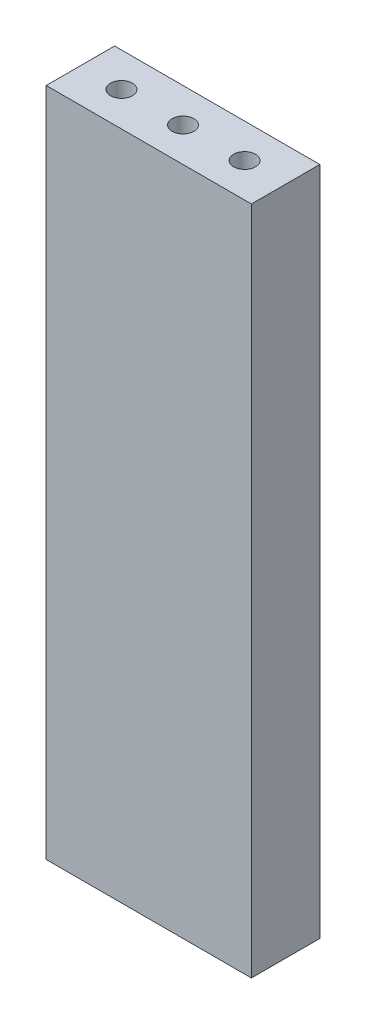
ISO-10303-21;
HEADER;
FILE_DESCRIPTION(('STEP AP214'),'2;1');
FILE_NAME('part.step','',(''),(''),'','','');
FILE_SCHEMA(('AUTOMOTIVE_DESIGN { 1 0 10303 214 1 1 1 1 }'));
ENDSEC;
DATA;
#1=APPLICATION_CONTEXT('core data for automotive mechanical design processes');
#2=APPLICATION_PROTOCOL_DEFINITION('international standard','automotive_design',2000,#1);
#3=PRODUCT_CONTEXT('',#1,'mechanical');
#4=PRODUCT('Part','Part','',(#3));
#5=PRODUCT_RELATED_PRODUCT_CATEGORY('part','',(#4));
#6=PRODUCT_DEFINITION_FORMATION('','',#4);
#7=PRODUCT_DEFINITION_CONTEXT('part definition',#1,'design');
#8=PRODUCT_DEFINITION('design','',#6,#7);
#9=PRODUCT_DEFINITION_SHAPE('','',#8);
#10=(LENGTH_UNIT() NAMED_UNIT(*) SI_UNIT(.MILLI.,.METRE.));
#11=(NAMED_UNIT(*) PLANE_ANGLE_UNIT() SI_UNIT($,.RADIAN.));
#12=(NAMED_UNIT(*) SI_UNIT($,.STERADIAN.) SOLID_ANGLE_UNIT());
#13=UNCERTAINTY_MEASURE_WITH_UNIT(LENGTH_MEASURE(1.E-05),#10,'distance_accuracy_value','');
#14=(GEOMETRIC_REPRESENTATION_CONTEXT(3) GLOBAL_UNCERTAINTY_ASSIGNED_CONTEXT((#13)) GLOBAL_UNIT_ASSIGNED_CONTEXT((#10,
#11,#12)) REPRESENTATION_CONTEXT('',''));
#15=CARTESIAN_POINT('',(0.,0.,0.));
#16=DIRECTION('',(0.,0.,1.));
#17=DIRECTION('',(1.,0.,0.));
#18=AXIS2_PLACEMENT_3D('',#15,#16,#17);
#19=CARTESIAN_POINT('',(7.5,-49.,2.5));
#20=DIRECTION('',(1.,0.,0.));
#21=DIRECTION('',(0.,0.,-1.));
#22=AXIS2_PLACEMENT_3D('',#19,#20,#21);
#23=PLANE('',#22);
#24=DIRECTION('',(0.,0.,-1.));
#25=VECTOR('',#24,1.);
#26=CARTESIAN_POINT('',(7.5,0.,2.5));
#27=LINE('',#26,#25);
#28=CARTESIAN_POINT('',(7.5,0.,2.5));
#29=VERTEX_POINT('',#28);
#30=CARTESIAN_POINT('',(7.5,0.,-2.5));
#31=VERTEX_POINT('',#30);
#32=EDGE_CURVE('E154',#29,#31,#27,.T.);
#33=ORIENTED_EDGE('',*,*,#32,.F.);
#34=DIRECTION('',(0.,1.,0.));
#35=VECTOR('',#34,1.);
#36=CARTESIAN_POINT('',(7.5,-49.,2.5));
#37=LINE('',#36,#35);
#38=CARTESIAN_POINT('',(7.5,-49.,2.5));
#39=VERTEX_POINT('',#38);
#40=EDGE_CURVE('E13',#39,#29,#37,.T.);
#41=ORIENTED_EDGE('',*,*,#40,.F.);
#42=DIRECTION('',(0.,0.,-1.));
#43=VECTOR('',#42,1.);
#44=CARTESIAN_POINT('',(7.5,-49.,2.5));
#45=LINE('',#44,#43);
#46=CARTESIAN_POINT('',(7.5,-49.,-2.5));
#47=VERTEX_POINT('',#46);
#48=EDGE_CURVE('E155',#39,#47,#45,.T.);
#49=ORIENTED_EDGE('',*,*,#48,.T.);
#50=DIRECTION('',(0.,1.,0.));
#51=VECTOR('',#50,1.);
#52=CARTESIAN_POINT('',(7.5,-49.,-2.5));
#53=LINE('',#52,#51);
#54=EDGE_CURVE('E48',#47,#31,#53,.T.);
#55=ORIENTED_EDGE('',*,*,#54,.T.);
#56=EDGE_LOOP('',(#33,#41,#49,#55));
#57=FACE_BOUND('',#56,.T.);
#58=ADVANCED_FACE('F45',(#57),#23,.T.);
#59=CARTESIAN_POINT('',(-7.5,-49.,2.5));
#60=DIRECTION('',(0.,0.,1.));
#61=DIRECTION('',(1.,0.,0.));
#62=AXIS2_PLACEMENT_3D('',#59,#60,#61);
#63=PLANE('',#62);
#64=DIRECTION('',(1.,0.,0.));
#65=VECTOR('',#64,1.);
#66=CARTESIAN_POINT('',(-7.5,0.,2.5));
#67=LINE('',#66,#65);
#68=CARTESIAN_POINT('',(-7.5,0.,2.5));
#69=VERTEX_POINT('',#68);
#70=EDGE_CURVE('E158',#69,#29,#67,.T.);
#71=ORIENTED_EDGE('',*,*,#70,.F.);
#72=DIRECTION('',(0.,1.,0.));
#73=VECTOR('',#72,1.);
#74=CARTESIAN_POINT('',(-7.5,-49.,2.5));
#75=LINE('',#74,#73);
#76=CARTESIAN_POINT('',(-7.5,-49.,2.5));
#77=VERTEX_POINT('',#76);
#78=EDGE_CURVE('E54',#77,#69,#75,.T.);
#79=ORIENTED_EDGE('',*,*,#78,.F.);
#80=DIRECTION('',(1.,0.,0.));
#81=VECTOR('',#80,1.);
#82=CARTESIAN_POINT('',(-7.5,-49.,2.5));
#83=LINE('',#82,#81);
#84=EDGE_CURVE('E162',#77,#39,#83,.T.);
#85=ORIENTED_EDGE('',*,*,#84,.T.);
#86=ORIENTED_EDGE('',*,*,#40,.T.);
#87=EDGE_LOOP('',(#71,#79,#85,#86));
#88=FACE_BOUND('',#87,.T.);
#89=ADVANCED_FACE('F177',(#88),#63,.T.);
#90=CARTESIAN_POINT('',(-7.5,-49.,2.5));
#91=DIRECTION('',(-1.,0.,0.));
#92=DIRECTION('',(0.,0.,1.));
#93=AXIS2_PLACEMENT_3D('',#90,#91,#92);
#94=PLANE('',#93);
#95=DIRECTION('',(0.,0.,1.));
#96=VECTOR('',#95,1.);
#97=CARTESIAN_POINT('',(-7.5,0.,2.5));
#98=LINE('',#97,#96);
#99=CARTESIAN_POINT('',(-7.5,0.,-2.5));
#100=VERTEX_POINT('',#99);
#101=EDGE_CURVE('E169',#100,#69,#98,.T.);
#102=ORIENTED_EDGE('',*,*,#101,.F.);
#103=DIRECTION('',(0.,1.,0.));
#104=VECTOR('',#103,1.);
#105=CARTESIAN_POINT('',(-7.5,-49.,-2.5));
#106=LINE('',#105,#104);
#107=CARTESIAN_POINT('',(-7.5,-49.,-2.5));
#108=VERTEX_POINT('',#107);
#109=EDGE_CURVE('E173',#108,#100,#106,.T.);
#110=ORIENTED_EDGE('',*,*,#109,.F.);
#111=DIRECTION('',(0.,0.,1.));
#112=VECTOR('',#111,1.);
#113=CARTESIAN_POINT('',(-7.5,-49.,2.5));
#114=LINE('',#113,#112);
#115=EDGE_CURVE('E160',#108,#77,#114,.T.);
#116=ORIENTED_EDGE('',*,*,#115,.T.);
#117=ORIENTED_EDGE('',*,*,#78,.T.);
#118=EDGE_LOOP('',(#102,#110,#116,#117));
#119=FACE_BOUND('',#118,.T.);
#120=ADVANCED_FACE('F180',(#119),#94,.T.);
#121=CARTESIAN_POINT('',(-7.5,-49.,-2.5));
#122=DIRECTION('',(0.,0.,-1.));
#123=DIRECTION('',(-1.,0.,0.));
#124=AXIS2_PLACEMENT_3D('',#121,#122,#123);
#125=PLANE('',#124);
#126=DIRECTION('',(-1.,0.,0.));
#127=VECTOR('',#126,1.);
#128=CARTESIAN_POINT('',(-7.5,0.,-2.5));
#129=LINE('',#128,#127);
#130=EDGE_CURVE('E166',#31,#100,#129,.T.);
#131=ORIENTED_EDGE('',*,*,#130,.F.);
#132=ORIENTED_EDGE('',*,*,#54,.F.);
#133=DIRECTION('',(-1.,0.,0.));
#134=VECTOR('',#133,1.);
#135=CARTESIAN_POINT('',(-7.5,-49.,-2.5));
#136=LINE('',#135,#134);
#137=EDGE_CURVE('E157',#47,#108,#136,.T.);
#138=ORIENTED_EDGE('',*,*,#137,.T.);
#139=ORIENTED_EDGE('',*,*,#109,.T.);
#140=EDGE_LOOP('',(#131,#132,#138,#139));
#141=FACE_BOUND('',#140,.T.);
#142=ADVANCED_FACE('F174',(#141),#125,.T.);
#143=CARTESIAN_POINT('',(7.5,-49.,-2.5));
#144=DIRECTION('',(0.,-1.,0.));
#145=DIRECTION('',(0.,0.,-1.));
#146=AXIS2_PLACEMENT_3D('',#143,#144,#145);
#147=PLANE('',#146);
#148=CARTESIAN_POINT('',(-4.5,-49.,0.));
#149=DIRECTION('',(0.,-1.,0.));
#150=DIRECTION('',(0.,0.,-1.));
#151=AXIS2_PLACEMENT_3D('',#148,#149,#150);
#152=CIRCLE('',#151,0.799999999999999);
#153=CARTESIAN_POINT('',(-4.5,-49.,-0.799999999999999));
#154=VERTEX_POINT('',#153);
#155=EDGE_CURVE('E136',#154,#154,#152,.T.);
#156=ORIENTED_EDGE('',*,*,#155,.F.);
#157=EDGE_LOOP('',(#156));
#158=FACE_BOUND('',#157,.T.);
#159=CARTESIAN_POINT('',(4.5,-49.,0.));
#160=DIRECTION('',(0.,-1.,0.));
#161=DIRECTION('',(0.,0.,-1.));
#162=AXIS2_PLACEMENT_3D('',#159,#160,#161);
#163=CIRCLE('',#162,0.799999999999999);
#164=CARTESIAN_POINT('',(4.5,-49.,-0.799999999999999));
#165=VERTEX_POINT('',#164);
#166=EDGE_CURVE('E142',#165,#165,#163,.T.);
#167=ORIENTED_EDGE('',*,*,#166,.F.);
#168=EDGE_LOOP('',(#167));
#169=FACE_BOUND('',#168,.T.);
#170=CARTESIAN_POINT('',(0.,-49.,0.));
#171=DIRECTION('',(0.,-1.,0.));
#172=DIRECTION('',(0.,0.,-1.));
#173=AXIS2_PLACEMENT_3D('',#170,#171,#172);
#174=CIRCLE('',#173,0.799999999999999);
#175=CARTESIAN_POINT('',(0.,-49.,-0.799999999999999));
#176=VERTEX_POINT('',#175);
#177=EDGE_CURVE('E148',#176,#176,#174,.T.);
#178=ORIENTED_EDGE('',*,*,#177,.F.);
#179=EDGE_LOOP('',(#178));
#180=FACE_BOUND('',#179,.T.);
#181=ORIENTED_EDGE('',*,*,#48,.F.);
#182=ORIENTED_EDGE('',*,*,#84,.F.);
#183=ORIENTED_EDGE('',*,*,#115,.F.);
#184=ORIENTED_EDGE('',*,*,#137,.F.);
#185=EDGE_LOOP('',(#181,#182,#183,#184));
#186=FACE_BOUND('',#185,.T.);
#187=ADVANCED_FACE('F182',(#158,#169,#180,#186),#147,.T.);
#188=CARTESIAN_POINT('',(7.5,0.,-2.5));
#189=DIRECTION('',(0.,-1.,0.));
#190=DIRECTION('',(0.,0.,-1.));
#191=AXIS2_PLACEMENT_3D('',#188,#189,#190);
#192=PLANE('',#191);
#193=CARTESIAN_POINT('',(-4.5,0.,0.));
#194=DIRECTION('',(0.,1.,0.));
#195=DIRECTION('',(0.,0.,1.));
#196=AXIS2_PLACEMENT_3D('',#193,#194,#195);
#197=CIRCLE('',#196,0.79999999999999);
#198=CARTESIAN_POINT('',(-4.5,0.,0.79999999999999));
#199=VERTEX_POINT('',#198);
#200=EDGE_CURVE('E120',#199,#199,#197,.T.);
#201=ORIENTED_EDGE('',*,*,#200,.F.);
#202=EDGE_LOOP('',(#201));
#203=FACE_BOUND('',#202,.T.);
#204=CARTESIAN_POINT('',(0.,0.,0.));
#205=DIRECTION('',(0.,1.,0.));
#206=DIRECTION('',(0.,0.,1.));
#207=AXIS2_PLACEMENT_3D('',#204,#205,#206);
#208=CIRCLE('',#207,0.79999999999999);
#209=CARTESIAN_POINT('',(0.,0.,0.79999999999999));
#210=VERTEX_POINT('',#209);
#211=EDGE_CURVE('E119',#210,#210,#208,.T.);
#212=ORIENTED_EDGE('',*,*,#211,.F.);
#213=EDGE_LOOP('',(#212));
#214=FACE_BOUND('',#213,.T.);
#215=CARTESIAN_POINT('',(4.5,0.,0.));
#216=DIRECTION('',(0.,1.,0.));
#217=DIRECTION('',(0.,0.,1.));
#218=AXIS2_PLACEMENT_3D('',#215,#216,#217);
#219=CIRCLE('',#218,0.79999999999999);
#220=CARTESIAN_POINT('',(4.5,0.,0.79999999999999));
#221=VERTEX_POINT('',#220);
#222=EDGE_CURVE('E130',#221,#221,#219,.T.);
#223=ORIENTED_EDGE('',*,*,#222,.F.);
#224=EDGE_LOOP('',(#223));
#225=FACE_BOUND('',#224,.T.);
#226=ORIENTED_EDGE('',*,*,#32,.T.);
#227=ORIENTED_EDGE('',*,*,#130,.T.);
#228=ORIENTED_EDGE('',*,*,#101,.T.);
#229=ORIENTED_EDGE('',*,*,#70,.T.);
#230=EDGE_LOOP('',(#226,#227,#228,#229));
#231=FACE_BOUND('',#230,.T.);
#232=ADVANCED_FACE('F176',(#203,#214,#225,#231),#192,.F.);
#233=CARTESIAN_POINT('',(0.,-37.8,0.));
#234=DIRECTION('',(0.,-1.,0.));
#235=DIRECTION('',(0.,0.,-1.));
#236=AXIS2_PLACEMENT_3D('',#233,#234,#235);
#237=CONICAL_SURFACE('',#236,0.799999999999998,1.02974425867666);
#238=CARTESIAN_POINT('',(0.,-37.319311504778,0.));
#239=VERTEX_POINT('',#238);
#240=VERTEX_LOOP('',#239);
#241=FACE_BOUND('',#240,.T.);
#242=CARTESIAN_POINT('',(0.,-37.8,0.));
#243=DIRECTION('',(0.,-1.,0.));
#244=DIRECTION('',(0.,0.,-1.));
#245=AXIS2_PLACEMENT_3D('',#242,#243,#244);
#246=CIRCLE('',#245,0.799999999999998);
#247=CARTESIAN_POINT('',(0.,-37.8,-0.799999999999998));
#248=VERTEX_POINT('',#247);
#249=EDGE_CURVE('E151',#248,#248,#246,.T.);
#250=ORIENTED_EDGE('',*,*,#249,.T.);
#251=EDGE_LOOP('',(#250));
#252=FACE_BOUND('',#251,.T.);
#253=ADVANCED_FACE('F190',(#241,#252),#237,.F.);
#254=CARTESIAN_POINT('',(0.,-49.,0.));
#255=DIRECTION('',(0.,-1.,0.));
#256=DIRECTION('',(0.,0.,-1.));
#257=AXIS2_PLACEMENT_3D('',#254,#255,#256);
#258=CYLINDRICAL_SURFACE('',#257,0.799999999999998);
#259=ORIENTED_EDGE('',*,*,#249,.F.);
#260=EDGE_LOOP('',(#259));
#261=FACE_BOUND('',#260,.T.);
#262=ORIENTED_EDGE('',*,*,#177,.T.);
#263=EDGE_LOOP('',(#262));
#264=FACE_BOUND('',#263,.T.);
#265=ADVANCED_FACE('F225',(#261,#264),#258,.F.);
#266=CARTESIAN_POINT('',(4.5,-37.8,0.));
#267=DIRECTION('',(0.,-1.,0.));
#268=DIRECTION('',(0.,0.,-1.));
#269=AXIS2_PLACEMENT_3D('',#266,#267,#268);
#270=CONICAL_SURFACE('',#269,0.799999999999998,1.02974425867666);
#271=CARTESIAN_POINT('',(4.5,-37.319311504778,0.));
#272=VERTEX_POINT('',#271);
#273=VERTEX_LOOP('',#272);
#274=FACE_BOUND('',#273,.T.);
#275=CARTESIAN_POINT('',(4.5,-37.8,0.));
#276=DIRECTION('',(0.,-1.,0.));
#277=DIRECTION('',(0.,0.,-1.));
#278=AXIS2_PLACEMENT_3D('',#275,#276,#277);
#279=CIRCLE('',#278,0.799999999999998);
#280=CARTESIAN_POINT('',(4.5,-37.8,-0.799999999999998));
#281=VERTEX_POINT('',#280);
#282=EDGE_CURVE('E145',#281,#281,#279,.T.);
#283=ORIENTED_EDGE('',*,*,#282,.T.);
#284=EDGE_LOOP('',(#283));
#285=FACE_BOUND('',#284,.T.);
#286=ADVANCED_FACE('F235',(#274,#285),#270,.F.);
#287=CARTESIAN_POINT('',(4.5,-49.,0.));
#288=DIRECTION('',(0.,-1.,0.));
#289=DIRECTION('',(0.,0.,-1.));
#290=AXIS2_PLACEMENT_3D('',#287,#288,#289);
#291=CYLINDRICAL_SURFACE('',#290,0.799999999999998);
#292=ORIENTED_EDGE('',*,*,#282,.F.);
#293=EDGE_LOOP('',(#292));
#294=FACE_BOUND('',#293,.T.);
#295=ORIENTED_EDGE('',*,*,#166,.T.);
#296=EDGE_LOOP('',(#295));
#297=FACE_BOUND('',#296,.T.);
#298=ADVANCED_FACE('F246',(#294,#297),#291,.F.);
#299=CARTESIAN_POINT('',(-4.5,-37.8,0.));
#300=DIRECTION('',(0.,-1.,0.));
#301=DIRECTION('',(0.,0.,-1.));
#302=AXIS2_PLACEMENT_3D('',#299,#300,#301);
#303=CONICAL_SURFACE('',#302,0.799999999999998,1.02974425867666);
#304=CARTESIAN_POINT('',(-4.5,-37.319311504778,0.));
#305=VERTEX_POINT('',#304);
#306=VERTEX_LOOP('',#305);
#307=FACE_BOUND('',#306,.T.);
#308=CARTESIAN_POINT('',(-4.5,-37.8,0.));
#309=DIRECTION('',(0.,-1.,0.));
#310=DIRECTION('',(0.,0.,-1.));
#311=AXIS2_PLACEMENT_3D('',#308,#309,#310);
#312=CIRCLE('',#311,0.799999999999998);
#313=CARTESIAN_POINT('',(-4.5,-37.8,-0.799999999999998));
#314=VERTEX_POINT('',#313);
#315=EDGE_CURVE('E139',#314,#314,#312,.T.);
#316=ORIENTED_EDGE('',*,*,#315,.T.);
#317=EDGE_LOOP('',(#316));
#318=FACE_BOUND('',#317,.T.);
#319=ADVANCED_FACE('F256',(#307,#318),#303,.F.);
#320=CARTESIAN_POINT('',(-4.5,-49.,0.));
#321=DIRECTION('',(0.,-1.,0.));
#322=DIRECTION('',(0.,0.,-1.));
#323=AXIS2_PLACEMENT_3D('',#320,#321,#322);
#324=CYLINDRICAL_SURFACE('',#323,0.799999999999998);
#325=ORIENTED_EDGE('',*,*,#315,.F.);
#326=EDGE_LOOP('',(#325));
#327=FACE_BOUND('',#326,.T.);
#328=ORIENTED_EDGE('',*,*,#155,.T.);
#329=EDGE_LOOP('',(#328));
#330=FACE_BOUND('',#329,.T.);
#331=ADVANCED_FACE('F267',(#327,#330),#324,.F.);
#332=CARTESIAN_POINT('',(4.5,-11.2,0.));
#333=DIRECTION('',(0.,1.,0.));
#334=DIRECTION('',(0.,0.,1.));
#335=AXIS2_PLACEMENT_3D('',#332,#333,#334);
#336=CONICAL_SURFACE('',#335,0.799999999999998,1.02974425867665);
#337=CARTESIAN_POINT('',(4.5,-11.680688495222,0.));
#338=VERTEX_POINT('',#337);
#339=VERTEX_LOOP('',#338);
#340=FACE_BOUND('',#339,.T.);
#341=CARTESIAN_POINT('',(4.5,-11.2,0.));
#342=DIRECTION('',(0.,1.,0.));
#343=DIRECTION('',(0.,0.,1.));
#344=AXIS2_PLACEMENT_3D('',#341,#342,#343);
#345=CIRCLE('',#344,0.799999999999998);
#346=CARTESIAN_POINT('',(4.5,-11.2,0.799999999999998));
#347=VERTEX_POINT('',#346);
#348=EDGE_CURVE('E133',#347,#347,#345,.T.);
#349=ORIENTED_EDGE('',*,*,#348,.T.);
#350=EDGE_LOOP('',(#349));
#351=FACE_BOUND('',#350,.T.);
#352=ADVANCED_FACE('F277',(#340,#351),#336,.F.);
#353=CARTESIAN_POINT('',(4.5,0.,0.));
#354=DIRECTION('',(0.,1.,0.));
#355=DIRECTION('',(0.,0.,1.));
#356=AXIS2_PLACEMENT_3D('',#353,#354,#355);
#357=CYLINDRICAL_SURFACE('',#356,0.799999999999994);
#358=ORIENTED_EDGE('',*,*,#348,.F.);
#359=EDGE_LOOP('',(#358));
#360=FACE_BOUND('',#359,.T.);
#361=ORIENTED_EDGE('',*,*,#222,.T.);
#362=EDGE_LOOP('',(#361));
#363=FACE_BOUND('',#362,.T.);
#364=ADVANCED_FACE('F293',(#360,#363),#357,.F.);
#365=CARTESIAN_POINT('',(0.,-11.2,0.));
#366=DIRECTION('',(0.,1.,0.));
#367=DIRECTION('',(0.,0.,1.));
#368=AXIS2_PLACEMENT_3D('',#365,#366,#367);
#369=CONICAL_SURFACE('',#368,0.799999999999997,1.02974425867665);
#370=CARTESIAN_POINT('',(0.,-11.680688495222,0.));
#371=VERTEX_POINT('',#370);
#372=VERTEX_LOOP('',#371);
#373=FACE_BOUND('',#372,.T.);
#374=CARTESIAN_POINT('',(0.,-11.2,0.));
#375=DIRECTION('',(0.,1.,0.));
#376=DIRECTION('',(0.,0.,1.));
#377=AXIS2_PLACEMENT_3D('',#374,#375,#376);
#378=CIRCLE('',#377,0.799999999999997);
#379=CARTESIAN_POINT('',(0.,-11.2,0.799999999999997));
#380=VERTEX_POINT('',#379);
#381=EDGE_CURVE('E123',#380,#380,#378,.T.);
#382=ORIENTED_EDGE('',*,*,#381,.T.);
#383=EDGE_LOOP('',(#382));
#384=FACE_BOUND('',#383,.T.);
#385=ADVANCED_FACE('F303',(#373,#384),#369,.F.);
#386=CARTESIAN_POINT('',(0.,0.,0.));
#387=DIRECTION('',(0.,1.,0.));
#388=DIRECTION('',(0.,0.,1.));
#389=AXIS2_PLACEMENT_3D('',#386,#387,#388);
#390=CYLINDRICAL_SURFACE('',#389,0.799999999999994);
#391=ORIENTED_EDGE('',*,*,#381,.F.);
#392=EDGE_LOOP('',(#391));
#393=FACE_BOUND('',#392,.T.);
#394=ORIENTED_EDGE('',*,*,#211,.T.);
#395=EDGE_LOOP('',(#394));
#396=FACE_BOUND('',#395,.T.);
#397=ADVANCED_FACE('F113',(#393,#396),#390,.F.);
#398=CARTESIAN_POINT('',(-4.5,-11.2,0.));
#399=DIRECTION('',(0.,1.,0.));
#400=DIRECTION('',(0.,0.,1.));
#401=AXIS2_PLACEMENT_3D('',#398,#399,#400);
#402=CONICAL_SURFACE('',#401,0.799999999999997,1.02974425867665);
#403=CARTESIAN_POINT('',(-4.5,-11.680688495222,0.));
#404=VERTEX_POINT('',#403);
#405=VERTEX_LOOP('',#404);
#406=FACE_BOUND('',#405,.T.);
#407=CARTESIAN_POINT('',(-4.5,-11.2,0.));
#408=DIRECTION('',(0.,1.,0.));
#409=DIRECTION('',(0.,0.,1.));
#410=AXIS2_PLACEMENT_3D('',#407,#408,#409);
#411=CIRCLE('',#410,0.799999999999997);
#412=CARTESIAN_POINT('',(-4.5,-11.2,0.799999999999997));
#413=VERTEX_POINT('',#412);
#414=EDGE_CURVE('E117',#413,#413,#411,.T.);
#415=ORIENTED_EDGE('',*,*,#414,.T.);
#416=EDGE_LOOP('',(#415));
#417=FACE_BOUND('',#416,.T.);
#418=ADVANCED_FACE('F109',(#406,#417),#402,.F.);
#419=CARTESIAN_POINT('',(-4.5,0.,0.));
#420=DIRECTION('',(0.,1.,0.));
#421=DIRECTION('',(0.,0.,1.));
#422=AXIS2_PLACEMENT_3D('',#419,#420,#421);
#423=CYLINDRICAL_SURFACE('',#422,0.799999999999994);
#424=ORIENTED_EDGE('',*,*,#414,.F.);
#425=EDGE_LOOP('',(#424));
#426=FACE_BOUND('',#425,.T.);
#427=ORIENTED_EDGE('',*,*,#200,.T.);
#428=EDGE_LOOP('',(#427));
#429=FACE_BOUND('',#428,.T.);
#430=ADVANCED_FACE('F112',(#426,#429),#423,.F.);
#431=CLOSED_SHELL('',(#58,#89,#120,#142,#187,#232,#253,#265,#286,#298,#319,#331,#352,#364,#385,
#397,#418,#430));
#432=MANIFOLD_SOLID_BREP('B2',#431);
#433=ADVANCED_BREP_SHAPE_REPRESENTATION('',(#18,#432),#14);
#434=SHAPE_DEFINITION_REPRESENTATION(#9,#433);
ENDSEC;
END-ISO-10303-21;
